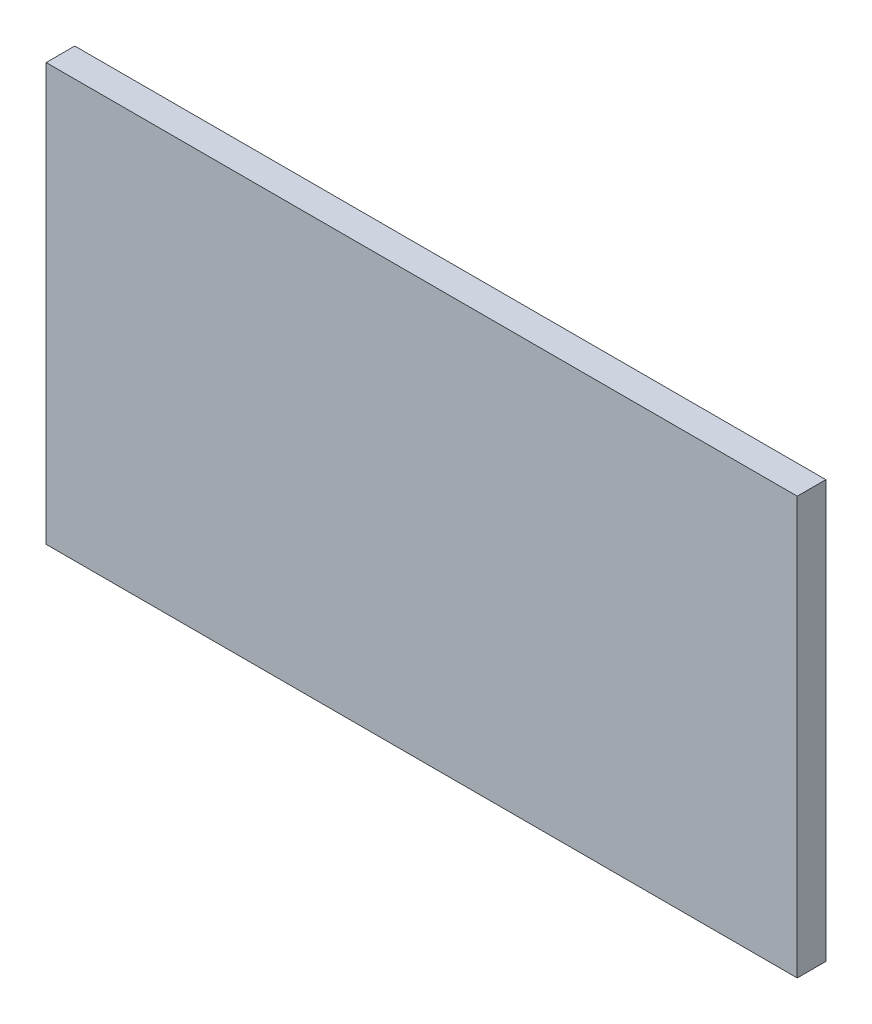
ISO-10303-21;
HEADER;
FILE_DESCRIPTION(('STEP AP214'),'2;1');
FILE_NAME('part.step','',(''),(''),'','','');
FILE_SCHEMA(('AUTOMOTIVE_DESIGN { 1 0 10303 214 1 1 1 1 }'));
ENDSEC;
DATA;
#1=APPLICATION_CONTEXT('core data for automotive mechanical design processes');
#2=APPLICATION_PROTOCOL_DEFINITION('international standard','automotive_design',2000,#1);
#3=PRODUCT_CONTEXT('',#1,'mechanical');
#4=PRODUCT('Part','Part','',(#3));
#5=PRODUCT_RELATED_PRODUCT_CATEGORY('part','',(#4));
#6=PRODUCT_DEFINITION_FORMATION('','',#4);
#7=PRODUCT_DEFINITION_CONTEXT('part definition',#1,'design');
#8=PRODUCT_DEFINITION('design','',#6,#7);
#9=PRODUCT_DEFINITION_SHAPE('','',#8);
#10=(LENGTH_UNIT() NAMED_UNIT(*) SI_UNIT(.MILLI.,.METRE.));
#11=(NAMED_UNIT(*) PLANE_ANGLE_UNIT() SI_UNIT($,.RADIAN.));
#12=(NAMED_UNIT(*) SI_UNIT($,.STERADIAN.) SOLID_ANGLE_UNIT());
#13=UNCERTAINTY_MEASURE_WITH_UNIT(LENGTH_MEASURE(1.E-05),#10,'distance_accuracy_value','');
#14=(GEOMETRIC_REPRESENTATION_CONTEXT(3) GLOBAL_UNCERTAINTY_ASSIGNED_CONTEXT((#13)) GLOBAL_UNIT_ASSIGNED_CONTEXT((#10,
#11,#12)) REPRESENTATION_CONTEXT('',''));
#15=CARTESIAN_POINT('',(0.,0.,0.));
#16=DIRECTION('',(0.,0.,1.));
#17=DIRECTION('',(1.,0.,0.));
#18=AXIS2_PLACEMENT_3D('',#15,#16,#17);
#19=CARTESIAN_POINT('',(0.70008,9.6,0.));
#20=DIRECTION('',(0.,0.,-1.));
#21=DIRECTION('',(-1.,0.,0.));
#22=AXIS2_PLACEMENT_3D('',#19,#20,#21);
#23=PLANE('',#22);
#24=DIRECTION('',(1.,0.,0.));
#25=VECTOR('',#24,1.);
#26=CARTESIAN_POINT('',(0.25008,9.85,0.));
#27=LINE('',#26,#25);
#28=CARTESIAN_POINT('',(0.25008,9.85,0.));
#29=VERTEX_POINT('',#28);
#30=CARTESIAN_POINT('',(1.15008,9.85,0.));
#31=VERTEX_POINT('',#30);
#32=EDGE_CURVE('E55',#29,#31,#27,.T.);
#33=ORIENTED_EDGE('',*,*,#32,.T.);
#34=DIRECTION('',(0.,1.,0.));
#35=VECTOR('',#34,1.);
#36=CARTESIAN_POINT('',(1.15008,9.85,0.));
#37=LINE('',#36,#35);
#38=CARTESIAN_POINT('',(1.15008,9.35,0.));
#39=VERTEX_POINT('',#38);
#40=EDGE_CURVE('E57',#31,#39,#37,.F.);
#41=ORIENTED_EDGE('',*,*,#40,.T.);
#42=DIRECTION('',(1.,0.,0.));
#43=VECTOR('',#42,1.);
#44=CARTESIAN_POINT('',(1.15008,9.35,0.));
#45=LINE('',#44,#43);
#46=CARTESIAN_POINT('',(0.25008,9.35,0.));
#47=VERTEX_POINT('',#46);
#48=EDGE_CURVE('E20',#39,#47,#45,.F.);
#49=ORIENTED_EDGE('',*,*,#48,.T.);
#50=DIRECTION('',(0.,1.,0.));
#51=VECTOR('',#50,1.);
#52=CARTESIAN_POINT('',(0.25008,9.35,0.));
#53=LINE('',#52,#51);
#54=EDGE_CURVE('E80',#47,#29,#53,.T.);
#55=ORIENTED_EDGE('',*,*,#54,.T.);
#56=EDGE_LOOP('',(#33,#41,#49,#55));
#57=FACE_BOUND('',#56,.T.);
#58=ADVANCED_FACE('F17',(#57),#23,.T.);
#59=CARTESIAN_POINT('',(1.15008,9.35,0.));
#60=DIRECTION('',(0.,1.,0.));
#61=DIRECTION('',(0.,0.,1.));
#62=AXIS2_PLACEMENT_3D('',#59,#60,#61);
#63=PLANE('',#62);
#64=DIRECTION('',(0.,0.,-1.));
#65=VECTOR('',#64,1.);
#66=CARTESIAN_POINT('',(0.25008,9.35,0.));
#67=LINE('',#66,#65);
#68=CARTESIAN_POINT('',(0.25008,9.35,0.03429));
#69=VERTEX_POINT('',#68);
#70=EDGE_CURVE('E68',#69,#47,#67,.T.);
#71=ORIENTED_EDGE('',*,*,#70,.T.);
#72=ORIENTED_EDGE('',*,*,#48,.F.);
#73=DIRECTION('',(0.,0.,1.));
#74=VECTOR('',#73,1.);
#75=CARTESIAN_POINT('',(1.15008,9.35,0.));
#76=LINE('',#75,#74);
#77=CARTESIAN_POINT('',(1.15008,9.35,0.03429));
#78=VERTEX_POINT('',#77);
#79=EDGE_CURVE('E63',#39,#78,#76,.T.);
#80=ORIENTED_EDGE('',*,*,#79,.T.);
#81=DIRECTION('',(1.,0.,0.));
#82=VECTOR('',#81,1.);
#83=CARTESIAN_POINT('',(0.70008,9.35,0.03429));
#84=LINE('',#83,#82);
#85=EDGE_CURVE('E83',#69,#78,#84,.T.);
#86=ORIENTED_EDGE('',*,*,#85,.F.);
#87=EDGE_LOOP('',(#71,#72,#80,#86));
#88=FACE_BOUND('',#87,.T.);
#89=ADVANCED_FACE('F65',(#88),#63,.F.);
#90=CARTESIAN_POINT('',(1.15008,9.85,0.));
#91=DIRECTION('',(-1.,0.,0.));
#92=DIRECTION('',(0.,0.,1.));
#93=AXIS2_PLACEMENT_3D('',#90,#91,#92);
#94=PLANE('',#93);
#95=ORIENTED_EDGE('',*,*,#79,.F.);
#96=ORIENTED_EDGE('',*,*,#40,.F.);
#97=DIRECTION('',(0.,0.,-1.));
#98=VECTOR('',#97,1.);
#99=CARTESIAN_POINT('',(1.15008,9.85,0.));
#100=LINE('',#99,#98);
#101=CARTESIAN_POINT('',(1.15008,9.85,0.03429));
#102=VERTEX_POINT('',#101);
#103=EDGE_CURVE('E75',#31,#102,#100,.F.);
#104=ORIENTED_EDGE('',*,*,#103,.T.);
#105=DIRECTION('',(0.,1.,0.));
#106=VECTOR('',#105,1.);
#107=CARTESIAN_POINT('',(1.15008,9.6,0.03429));
#108=LINE('',#107,#106);
#109=EDGE_CURVE('E72',#78,#102,#108,.T.);
#110=ORIENTED_EDGE('',*,*,#109,.F.);
#111=EDGE_LOOP('',(#95,#96,#104,#110));
#112=FACE_BOUND('',#111,.T.);
#113=ADVANCED_FACE('F70',(#112),#94,.F.);
#114=CARTESIAN_POINT('',(0.25008,9.85,0.));
#115=DIRECTION('',(0.,-1.,0.));
#116=DIRECTION('',(0.,0.,-1.));
#117=AXIS2_PLACEMENT_3D('',#114,#115,#116);
#118=PLANE('',#117);
#119=ORIENTED_EDGE('',*,*,#103,.F.);
#120=ORIENTED_EDGE('',*,*,#32,.F.);
#121=DIRECTION('',(0.,0.,-1.));
#122=VECTOR('',#121,1.);
#123=CARTESIAN_POINT('',(0.25008,9.85,0.));
#124=LINE('',#123,#122);
#125=CARTESIAN_POINT('',(0.25008,9.85,0.03429));
#126=VERTEX_POINT('',#125);
#127=EDGE_CURVE('E35',#29,#126,#124,.F.);
#128=ORIENTED_EDGE('',*,*,#127,.T.);
#129=DIRECTION('',(1.,0.,0.));
#130=VECTOR('',#129,1.);
#131=CARTESIAN_POINT('',(0.70008,9.85,0.03429));
#132=LINE('',#131,#130);
#133=EDGE_CURVE('E26',#102,#126,#132,.F.);
#134=ORIENTED_EDGE('',*,*,#133,.F.);
#135=EDGE_LOOP('',(#119,#120,#128,#134));
#136=FACE_BOUND('',#135,.T.);
#137=ADVANCED_FACE('F89',(#136),#118,.F.);
#138=CARTESIAN_POINT('',(0.25008,9.35,0.));
#139=DIRECTION('',(1.,0.,0.));
#140=DIRECTION('',(0.,0.,-1.));
#141=AXIS2_PLACEMENT_3D('',#138,#139,#140);
#142=PLANE('',#141);
#143=ORIENTED_EDGE('',*,*,#127,.F.);
#144=ORIENTED_EDGE('',*,*,#54,.F.);
#145=ORIENTED_EDGE('',*,*,#70,.F.);
#146=DIRECTION('',(0.,1.,0.));
#147=VECTOR('',#146,1.);
#148=CARTESIAN_POINT('',(0.25008,9.6,0.03429));
#149=LINE('',#148,#147);
#150=EDGE_CURVE('E11',#126,#69,#149,.F.);
#151=ORIENTED_EDGE('',*,*,#150,.F.);
#152=EDGE_LOOP('',(#143,#144,#145,#151));
#153=FACE_BOUND('',#152,.T.);
#154=ADVANCED_FACE('F91',(#153),#142,.F.);
#155=CARTESIAN_POINT('',(0.70008,9.6,0.03429));
#156=DIRECTION('',(0.,0.,1.));
#157=DIRECTION('',(1.,0.,0.));
#158=AXIS2_PLACEMENT_3D('',#155,#156,#157);
#159=PLANE('',#158);
#160=ORIENTED_EDGE('',*,*,#133,.T.);
#161=ORIENTED_EDGE('',*,*,#150,.T.);
#162=ORIENTED_EDGE('',*,*,#85,.T.);
#163=ORIENTED_EDGE('',*,*,#109,.T.);
#164=EDGE_LOOP('',(#160,#161,#162,#163));
#165=FACE_BOUND('',#164,.T.);
#166=ADVANCED_FACE('F88',(#165),#159,.T.);
#167=CLOSED_SHELL('',(#58,#89,#113,#137,#154,#166));
#168=MANIFOLD_SOLID_BREP('B1',#167);
#169=ADVANCED_BREP_SHAPE_REPRESENTATION('',(#18,#168),#14);
#170=SHAPE_DEFINITION_REPRESENTATION(#9,#169);
ENDSEC;
END-ISO-10303-21;
